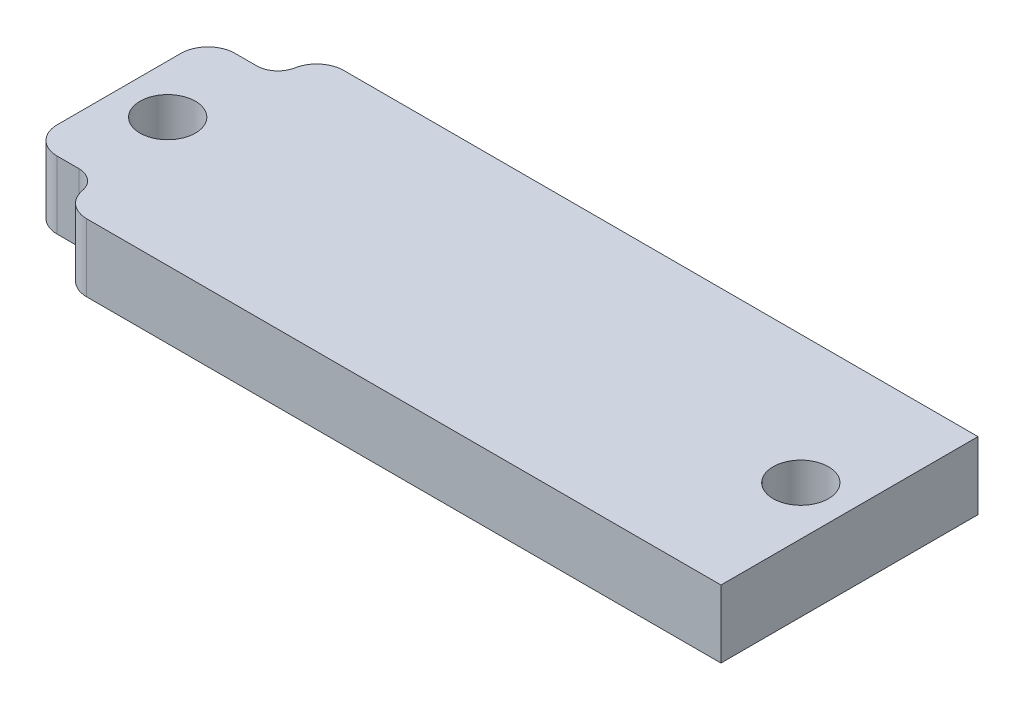
ISO-10303-21;
HEADER;
FILE_DESCRIPTION(('STEP AP214'),'2;1');
FILE_NAME('part.step','',(''),(''),'','','');
FILE_SCHEMA(('AUTOMOTIVE_DESIGN { 1 0 10303 214 1 1 1 1 }'));
ENDSEC;
DATA;
#1=APPLICATION_CONTEXT('core data for automotive mechanical design processes');
#2=APPLICATION_PROTOCOL_DEFINITION('international standard','automotive_design',2000,#1);
#3=PRODUCT_CONTEXT('',#1,'mechanical');
#4=PRODUCT('Part','Part','',(#3));
#5=PRODUCT_RELATED_PRODUCT_CATEGORY('part','',(#4));
#6=PRODUCT_DEFINITION_FORMATION('','',#4);
#7=PRODUCT_DEFINITION_CONTEXT('part definition',#1,'design');
#8=PRODUCT_DEFINITION('design','',#6,#7);
#9=PRODUCT_DEFINITION_SHAPE('','',#8);
#10=(LENGTH_UNIT() NAMED_UNIT(*) SI_UNIT(.MILLI.,.METRE.));
#11=(NAMED_UNIT(*) PLANE_ANGLE_UNIT() SI_UNIT($,.RADIAN.));
#12=(NAMED_UNIT(*) SI_UNIT($,.STERADIAN.) SOLID_ANGLE_UNIT());
#13=UNCERTAINTY_MEASURE_WITH_UNIT(LENGTH_MEASURE(1.E-05),#10,'distance_accuracy_value','');
#14=(GEOMETRIC_REPRESENTATION_CONTEXT(3) GLOBAL_UNCERTAINTY_ASSIGNED_CONTEXT((#13)) GLOBAL_UNIT_ASSIGNED_CONTEXT((#10,
#11,#12)) REPRESENTATION_CONTEXT('',''));
#15=CARTESIAN_POINT('',(0.,0.,0.));
#16=DIRECTION('',(0.,0.,1.));
#17=DIRECTION('',(1.,0.,0.));
#18=AXIS2_PLACEMENT_3D('',#15,#16,#17);
#19=CARTESIAN_POINT('',(0.,6.35,0.));
#20=DIRECTION('',(0.,-1.,0.));
#21=DIRECTION('',(0.,0.,-1.));
#22=AXIS2_PLACEMENT_3D('',#19,#20,#21);
#23=PLANE('',#22);
#24=CARTESIAN_POINT('',(4.57,6.35,-12.065));
#25=DIRECTION('',(0.,1.,0.));
#26=DIRECTION('',(0.,0.,1.));
#27=AXIS2_PLACEMENT_3D('',#24,#25,#26);
#28=CIRCLE('',#27,2.6);
#29=CARTESIAN_POINT('',(4.57,6.35,-9.465));
#30=VERTEX_POINT('',#29);
#31=EDGE_CURVE('E170',#30,#30,#28,.T.);
#32=ORIENTED_EDGE('',*,*,#31,.F.);
#33=EDGE_LOOP('',(#32));
#34=FACE_BOUND('',#33,.T.);
#35=CARTESIAN_POINT('',(64.01,6.35,-12.065));
#36=DIRECTION('',(0.,1.,0.));
#37=DIRECTION('',(0.,0.,1.));
#38=AXIS2_PLACEMENT_3D('',#35,#36,#37);
#39=CIRCLE('',#38,2.59999999999999);
#40=CARTESIAN_POINT('',(64.01,6.35,-9.46500000000001));
#41=VERTEX_POINT('',#40);
#42=EDGE_CURVE('E164',#41,#41,#39,.T.);
#43=ORIENTED_EDGE('',*,*,#42,.F.);
#44=EDGE_LOOP('',(#43));
#45=FACE_BOUND('',#44,.T.);
#46=CARTESIAN_POINT('',(4.57,6.35,-1.715));
#47=DIRECTION('',(0.,1.,0.));
#48=DIRECTION('',(0.,0.,1.));
#49=AXIS2_PLACEMENT_3D('',#46,#47,#48);
#50=CIRCLE('',#49,2.);
#51=CARTESIAN_POINT('',(4.57,6.35,-3.715));
#52=VERTEX_POINT('',#51);
#53=CARTESIAN_POINT('',(6.53670134597141,6.35,-2.07843612334802));
#54=VERTEX_POINT('',#53);
#55=EDGE_CURVE('E136',#52,#54,#50,.F.);
#56=ORIENTED_EDGE('',*,*,#55,.T.);
#57=CARTESIAN_POINT('',(9.03441205535511,6.35,-2.54));
#58=DIRECTION('',(0.,-1.,0.));
#59=DIRECTION('',(0.,0.,-1.));
#60=AXIS2_PLACEMENT_3D('',#57,#58,#59);
#61=CIRCLE('',#60,2.54);
#62=CARTESIAN_POINT('',(9.03441205535511,6.35,0.));
#63=VERTEX_POINT('',#62);
#64=EDGE_CURVE('E209',#54,#63,#61,.F.);
#65=ORIENTED_EDGE('',*,*,#64,.T.);
#66=DIRECTION('',(1.,0.,0.));
#67=VECTOR('',#66,1.);
#68=CARTESIAN_POINT('',(0.,6.35,0.));
#69=LINE('',#68,#67);
#70=CARTESIAN_POINT('',(68.58,6.35,0.));
#71=VERTEX_POINT('',#70);
#72=EDGE_CURVE('E179',#63,#71,#69,.T.);
#73=ORIENTED_EDGE('',*,*,#72,.T.);
#74=DIRECTION('',(0.,0.,-1.));
#75=VECTOR('',#74,1.);
#76=CARTESIAN_POINT('',(68.58,6.35,0.));
#77=LINE('',#76,#75);
#78=CARTESIAN_POINT('',(68.58,6.35,-24.13));
#79=VERTEX_POINT('',#78);
#80=EDGE_CURVE('E182',#71,#79,#77,.T.);
#81=ORIENTED_EDGE('',*,*,#80,.T.);
#82=DIRECTION('',(-1.,0.,0.));
#83=VECTOR('',#82,1.);
#84=CARTESIAN_POINT('',(0.,6.35,-24.13));
#85=LINE('',#84,#83);
#86=CARTESIAN_POINT('',(9.03441205535511,6.35,-24.13));
#87=VERTEX_POINT('',#86);
#88=EDGE_CURVE('E184',#79,#87,#85,.T.);
#89=ORIENTED_EDGE('',*,*,#88,.T.);
#90=CARTESIAN_POINT('',(9.03441205535511,6.35,-21.59));
#91=DIRECTION('',(0.,-1.,0.));
#92=DIRECTION('',(0.,0.,-1.));
#93=AXIS2_PLACEMENT_3D('',#90,#91,#92);
#94=CIRCLE('',#93,2.54);
#95=CARTESIAN_POINT('',(6.53670134597141,6.35,-22.051563876652));
#96=VERTEX_POINT('',#95);
#97=EDGE_CURVE('E203',#87,#96,#94,.F.);
#98=ORIENTED_EDGE('',*,*,#97,.T.);
#99=CARTESIAN_POINT('',(4.57,6.35,-22.415));
#100=DIRECTION('',(0.,1.,0.));
#101=DIRECTION('',(0.,0.,1.));
#102=AXIS2_PLACEMENT_3D('',#99,#100,#101);
#103=CIRCLE('',#102,2.);
#104=CARTESIAN_POINT('',(4.57,6.35,-20.415));
#105=VERTEX_POINT('',#104);
#106=EDGE_CURVE('E147',#105,#96,#103,.T.);
#107=ORIENTED_EDGE('',*,*,#106,.F.);
#108=DIRECTION('',(-1.,0.,0.));
#109=VECTOR('',#108,1.);
#110=CARTESIAN_POINT('',(0.,6.35,-20.415));
#111=LINE('',#110,#109);
#112=CARTESIAN_POINT('',(2.54,6.35,-20.415));
#113=VERTEX_POINT('',#112);
#114=EDGE_CURVE('E132',#105,#113,#111,.T.);
#115=ORIENTED_EDGE('',*,*,#114,.T.);
#116=CARTESIAN_POINT('',(2.54,6.35,-17.875));
#117=DIRECTION('',(0.,-1.,0.));
#118=DIRECTION('',(0.,0.,-1.));
#119=AXIS2_PLACEMENT_3D('',#116,#117,#118);
#120=CIRCLE('',#119,2.54);
#121=CARTESIAN_POINT('',(0.,6.35,-17.875));
#122=VERTEX_POINT('',#121);
#123=EDGE_CURVE('E205',#113,#122,#120,.F.);
#124=ORIENTED_EDGE('',*,*,#123,.T.);
#125=DIRECTION('',(0.,0.,1.));
#126=VECTOR('',#125,1.);
#127=CARTESIAN_POINT('',(0.,6.35,0.));
#128=LINE('',#127,#126);
#129=CARTESIAN_POINT('',(0.,6.35,-6.255));
#130=VERTEX_POINT('',#129);
#131=EDGE_CURVE('E176',#122,#130,#128,.T.);
#132=ORIENTED_EDGE('',*,*,#131,.T.);
#133=CARTESIAN_POINT('',(2.54,6.35,-6.255));
#134=DIRECTION('',(0.,-1.,0.));
#135=DIRECTION('',(0.,0.,-1.));
#136=AXIS2_PLACEMENT_3D('',#133,#134,#135);
#137=CIRCLE('',#136,2.54);
#138=CARTESIAN_POINT('',(2.54,6.35,-3.715));
#139=VERTEX_POINT('',#138);
#140=EDGE_CURVE('E207',#130,#139,#137,.F.);
#141=ORIENTED_EDGE('',*,*,#140,.T.);
#142=DIRECTION('',(-1.,0.,0.));
#143=VECTOR('',#142,1.);
#144=CARTESIAN_POINT('',(0.,6.35,-3.715));
#145=LINE('',#144,#143);
#146=EDGE_CURVE('E156',#52,#139,#145,.T.);
#147=ORIENTED_EDGE('',*,*,#146,.F.);
#148=EDGE_LOOP('',(#56,#65,#73,#81,#89,#98,#107,#115,#124,#132,#141,#147));
#149=FACE_BOUND('',#148,.T.);
#150=ADVANCED_FACE('F32',(#34,#45,#149),#23,.F.);
#151=CARTESIAN_POINT('',(0.,0.,0.));
#152=DIRECTION('',(0.,-1.,0.));
#153=DIRECTION('',(0.,0.,-1.));
#154=AXIS2_PLACEMENT_3D('',#151,#152,#153);
#155=PLANE('',#154);
#156=CARTESIAN_POINT('',(4.57,0.,-12.065));
#157=DIRECTION('',(0.,1.,0.));
#158=DIRECTION('',(0.,0.,1.));
#159=AXIS2_PLACEMENT_3D('',#156,#157,#158);
#160=CIRCLE('',#159,2.6);
#161=CARTESIAN_POINT('',(4.57,0.,-9.465));
#162=VERTEX_POINT('',#161);
#163=EDGE_CURVE('E167',#162,#162,#160,.T.);
#164=ORIENTED_EDGE('',*,*,#163,.T.);
#165=EDGE_LOOP('',(#164));
#166=FACE_BOUND('',#165,.T.);
#167=CARTESIAN_POINT('',(64.01,0.,-12.065));
#168=DIRECTION('',(0.,1.,0.));
#169=DIRECTION('',(0.,0.,1.));
#170=AXIS2_PLACEMENT_3D('',#167,#168,#169);
#171=CIRCLE('',#170,2.59999999999999);
#172=CARTESIAN_POINT('',(64.01,0.,-9.46500000000001));
#173=VERTEX_POINT('',#172);
#174=EDGE_CURVE('E163',#173,#173,#171,.T.);
#175=ORIENTED_EDGE('',*,*,#174,.T.);
#176=EDGE_LOOP('',(#175));
#177=FACE_BOUND('',#176,.T.);
#178=DIRECTION('',(1.,0.,0.));
#179=VECTOR('',#178,1.);
#180=CARTESIAN_POINT('',(0.,0.,0.));
#181=LINE('',#180,#179);
#182=CARTESIAN_POINT('',(9.03441205535511,0.,0.));
#183=VERTEX_POINT('',#182);
#184=CARTESIAN_POINT('',(68.58,0.,0.));
#185=VERTEX_POINT('',#184);
#186=EDGE_CURVE('E190',#183,#185,#181,.T.);
#187=ORIENTED_EDGE('',*,*,#186,.F.);
#188=CARTESIAN_POINT('',(9.03441205535511,0.,-2.54));
#189=DIRECTION('',(0.,-1.,0.));
#190=DIRECTION('',(0.,0.,-1.));
#191=AXIS2_PLACEMENT_3D('',#188,#189,#190);
#192=CIRCLE('',#191,2.54);
#193=CARTESIAN_POINT('',(6.53670134597141,0.,-2.07843612334802));
#194=VERTEX_POINT('',#193);
#195=EDGE_CURVE('E217',#183,#194,#192,.T.);
#196=ORIENTED_EDGE('',*,*,#195,.T.);
#197=CARTESIAN_POINT('',(4.57,0.,-1.715));
#198=DIRECTION('',(0.,1.,0.));
#199=DIRECTION('',(0.,0.,1.));
#200=AXIS2_PLACEMENT_3D('',#197,#198,#199);
#201=CIRCLE('',#200,2.);
#202=CARTESIAN_POINT('',(4.57,0.,-3.715));
#203=VERTEX_POINT('',#202);
#204=EDGE_CURVE('E152',#203,#194,#201,.F.);
#205=ORIENTED_EDGE('',*,*,#204,.F.);
#206=DIRECTION('',(-1.,0.,0.));
#207=VECTOR('',#206,1.);
#208=CARTESIAN_POINT('',(0.,0.,-3.715));
#209=LINE('',#208,#207);
#210=CARTESIAN_POINT('',(2.54,0.,-3.715));
#211=VERTEX_POINT('',#210);
#212=EDGE_CURVE('E155',#203,#211,#209,.T.);
#213=ORIENTED_EDGE('',*,*,#212,.T.);
#214=CARTESIAN_POINT('',(2.54,0.,-6.255));
#215=DIRECTION('',(0.,-1.,0.));
#216=DIRECTION('',(0.,0.,-1.));
#217=AXIS2_PLACEMENT_3D('',#214,#215,#216);
#218=CIRCLE('',#217,2.54);
#219=CARTESIAN_POINT('',(0.,0.,-6.255));
#220=VERTEX_POINT('',#219);
#221=EDGE_CURVE('E215',#211,#220,#218,.T.);
#222=ORIENTED_EDGE('',*,*,#221,.T.);
#223=DIRECTION('',(0.,0.,1.));
#224=VECTOR('',#223,1.);
#225=CARTESIAN_POINT('',(0.,0.,0.));
#226=LINE('',#225,#224);
#227=CARTESIAN_POINT('',(0.,0.,-17.875));
#228=VERTEX_POINT('',#227);
#229=EDGE_CURVE('E173',#228,#220,#226,.T.);
#230=ORIENTED_EDGE('',*,*,#229,.F.);
#231=CARTESIAN_POINT('',(2.54,0.,-17.875));
#232=DIRECTION('',(0.,-1.,0.));
#233=DIRECTION('',(0.,0.,-1.));
#234=AXIS2_PLACEMENT_3D('',#231,#232,#233);
#235=CIRCLE('',#234,2.54);
#236=CARTESIAN_POINT('',(2.54,0.,-20.415));
#237=VERTEX_POINT('',#236);
#238=EDGE_CURVE('E146',#228,#237,#235,.T.);
#239=ORIENTED_EDGE('',*,*,#238,.T.);
#240=DIRECTION('',(-1.,0.,0.));
#241=VECTOR('',#240,1.);
#242=CARTESIAN_POINT('',(0.,0.,-20.415));
#243=LINE('',#242,#241);
#244=CARTESIAN_POINT('',(4.57,0.,-20.415));
#245=VERTEX_POINT('',#244);
#246=EDGE_CURVE('E129',#245,#237,#243,.T.);
#247=ORIENTED_EDGE('',*,*,#246,.F.);
#248=CARTESIAN_POINT('',(4.57,0.,-22.415));
#249=DIRECTION('',(0.,1.,0.));
#250=DIRECTION('',(0.,0.,1.));
#251=AXIS2_PLACEMENT_3D('',#248,#249,#250);
#252=CIRCLE('',#251,2.);
#253=CARTESIAN_POINT('',(6.53670134597141,0.,-22.051563876652));
#254=VERTEX_POINT('',#253);
#255=EDGE_CURVE('E137',#245,#254,#252,.T.);
#256=ORIENTED_EDGE('',*,*,#255,.T.);
#257=CARTESIAN_POINT('',(9.03441205535511,0.,-21.59));
#258=DIRECTION('',(0.,-1.,0.));
#259=DIRECTION('',(0.,0.,-1.));
#260=AXIS2_PLACEMENT_3D('',#257,#258,#259);
#261=CIRCLE('',#260,2.54);
#262=CARTESIAN_POINT('',(9.03441205535511,0.,-24.13));
#263=VERTEX_POINT('',#262);
#264=EDGE_CURVE('E55',#254,#263,#261,.T.);
#265=ORIENTED_EDGE('',*,*,#264,.T.);
#266=DIRECTION('',(-1.,0.,0.));
#267=VECTOR('',#266,1.);
#268=CARTESIAN_POINT('',(0.,0.,-24.13));
#269=LINE('',#268,#267);
#270=CARTESIAN_POINT('',(68.58,0.,-24.13));
#271=VERTEX_POINT('',#270);
#272=EDGE_CURVE('E180',#271,#263,#269,.T.);
#273=ORIENTED_EDGE('',*,*,#272,.F.);
#274=DIRECTION('',(0.,0.,-1.));
#275=VECTOR('',#274,1.);
#276=CARTESIAN_POINT('',(68.58,0.,0.));
#277=LINE('',#276,#275);
#278=EDGE_CURVE('E192',#185,#271,#277,.T.);
#279=ORIENTED_EDGE('',*,*,#278,.F.);
#280=EDGE_LOOP('',(#187,#196,#205,#213,#222,#230,#239,#247,#256,#265,#273,#279));
#281=FACE_BOUND('',#280,.T.);
#282=ADVANCED_FACE('F143',(#166,#177,#281),#155,.T.);
#283=CARTESIAN_POINT('',(0.,6.35,0.));
#284=DIRECTION('',(1.,0.,0.));
#285=DIRECTION('',(0.,0.,-1.));
#286=AXIS2_PLACEMENT_3D('',#283,#284,#285);
#287=PLANE('',#286);
#288=ORIENTED_EDGE('',*,*,#229,.T.);
#289=DIRECTION('',(0.,1.,0.));
#290=VECTOR('',#289,1.);
#291=CARTESIAN_POINT('',(0.,6.35,-6.255));
#292=LINE('',#291,#290);
#293=EDGE_CURVE('E221',#220,#130,#292,.T.);
#294=ORIENTED_EDGE('',*,*,#293,.T.);
#295=ORIENTED_EDGE('',*,*,#131,.F.);
#296=DIRECTION('',(0.,1.,0.));
#297=VECTOR('',#296,1.);
#298=CARTESIAN_POINT('',(0.,0.,-17.875));
#299=LINE('',#298,#297);
#300=EDGE_CURVE('E219',#122,#228,#299,.F.);
#301=ORIENTED_EDGE('',*,*,#300,.T.);
#302=EDGE_LOOP('',(#288,#294,#295,#301));
#303=FACE_BOUND('',#302,.T.);
#304=ADVANCED_FACE('F257',(#303),#287,.F.);
#305=CARTESIAN_POINT('',(0.,6.35,0.));
#306=DIRECTION('',(0.,0.,-1.));
#307=DIRECTION('',(-1.,0.,0.));
#308=AXIS2_PLACEMENT_3D('',#305,#306,#307);
#309=PLANE('',#308);
#310=ORIENTED_EDGE('',*,*,#72,.F.);
#311=DIRECTION('',(0.,-1.,0.));
#312=VECTOR('',#311,1.);
#313=CARTESIAN_POINT('',(9.03441205535511,0.,0.));
#314=LINE('',#313,#312);
#315=EDGE_CURVE('E211',#63,#183,#314,.T.);
#316=ORIENTED_EDGE('',*,*,#315,.T.);
#317=ORIENTED_EDGE('',*,*,#186,.T.);
#318=DIRECTION('',(0.,-1.,0.));
#319=VECTOR('',#318,1.);
#320=CARTESIAN_POINT('',(68.58,6.35,0.));
#321=LINE('',#320,#319);
#322=EDGE_CURVE('E197',#71,#185,#321,.T.);
#323=ORIENTED_EDGE('',*,*,#322,.F.);
#324=EDGE_LOOP('',(#310,#316,#317,#323));
#325=FACE_BOUND('',#324,.T.);
#326=ADVANCED_FACE('F284',(#325),#309,.F.);
#327=CARTESIAN_POINT('',(68.58,6.35,0.));
#328=DIRECTION('',(-1.,0.,0.));
#329=DIRECTION('',(0.,0.,1.));
#330=AXIS2_PLACEMENT_3D('',#327,#328,#329);
#331=PLANE('',#330);
#332=ORIENTED_EDGE('',*,*,#278,.T.);
#333=DIRECTION('',(0.,-1.,0.));
#334=VECTOR('',#333,1.);
#335=CARTESIAN_POINT('',(68.58,6.35,-24.13));
#336=LINE('',#335,#334);
#337=EDGE_CURVE('E187',#79,#271,#336,.T.);
#338=ORIENTED_EDGE('',*,*,#337,.F.);
#339=ORIENTED_EDGE('',*,*,#80,.F.);
#340=ORIENTED_EDGE('',*,*,#322,.T.);
#341=EDGE_LOOP('',(#332,#338,#339,#340));
#342=FACE_BOUND('',#341,.T.);
#343=ADVANCED_FACE('F238',(#342),#331,.F.);
#344=CARTESIAN_POINT('',(0.,6.35,-24.13));
#345=DIRECTION('',(0.,0.,1.));
#346=DIRECTION('',(1.,0.,0.));
#347=AXIS2_PLACEMENT_3D('',#344,#345,#346);
#348=PLANE('',#347);
#349=ORIENTED_EDGE('',*,*,#272,.T.);
#350=DIRECTION('',(0.,1.,0.));
#351=VECTOR('',#350,1.);
#352=CARTESIAN_POINT('',(9.03441205535511,6.35,-24.13));
#353=LINE('',#352,#351);
#354=EDGE_CURVE('E40',#263,#87,#353,.T.);
#355=ORIENTED_EDGE('',*,*,#354,.T.);
#356=ORIENTED_EDGE('',*,*,#88,.F.);
#357=ORIENTED_EDGE('',*,*,#337,.T.);
#358=EDGE_LOOP('',(#349,#355,#356,#357));
#359=FACE_BOUND('',#358,.T.);
#360=ADVANCED_FACE('F230',(#359),#348,.F.);
#361=CARTESIAN_POINT('',(4.57,6.35,-12.065));
#362=DIRECTION('',(0.,-1.,0.));
#363=DIRECTION('',(0.,0.,-1.));
#364=AXIS2_PLACEMENT_3D('',#361,#362,#363);
#365=CYLINDRICAL_SURFACE('',#364,2.6);
#366=ORIENTED_EDGE('',*,*,#31,.T.);
#367=EDGE_LOOP('',(#366));
#368=FACE_BOUND('',#367,.T.);
#369=ORIENTED_EDGE('',*,*,#163,.F.);
#370=EDGE_LOOP('',(#369));
#371=FACE_BOUND('',#370,.T.);
#372=ADVANCED_FACE('F277',(#368,#371),#365,.F.);
#373=CARTESIAN_POINT('',(64.01,6.35,-12.065));
#374=DIRECTION('',(0.,-1.,0.));
#375=DIRECTION('',(0.,0.,-1.));
#376=AXIS2_PLACEMENT_3D('',#373,#374,#375);
#377=CYLINDRICAL_SURFACE('',#376,2.59999999999999);
#378=ORIENTED_EDGE('',*,*,#42,.T.);
#379=EDGE_LOOP('',(#378));
#380=FACE_BOUND('',#379,.T.);
#381=ORIENTED_EDGE('',*,*,#174,.F.);
#382=EDGE_LOOP('',(#381));
#383=FACE_BOUND('',#382,.T.);
#384=ADVANCED_FACE('F341',(#380,#383),#377,.F.);
#385=CARTESIAN_POINT('',(4.57,0.,-1.715));
#386=DIRECTION('',(0.,1.,0.));
#387=DIRECTION('',(0.,0.,1.));
#388=AXIS2_PLACEMENT_3D('',#385,#386,#387);
#389=CYLINDRICAL_SURFACE('',#388,2.);
#390=ORIENTED_EDGE('',*,*,#204,.T.);
#391=DIRECTION('',(0.,1.,0.));
#392=VECTOR('',#391,1.);
#393=CARTESIAN_POINT('',(6.53670134597141,0.,-2.07843612334802));
#394=LINE('',#393,#392);
#395=EDGE_CURVE('E200',#194,#54,#394,.T.);
#396=ORIENTED_EDGE('',*,*,#395,.T.);
#397=ORIENTED_EDGE('',*,*,#55,.F.);
#398=DIRECTION('',(0.,1.,0.));
#399=VECTOR('',#398,1.);
#400=CARTESIAN_POINT('',(4.57,0.,-3.715));
#401=LINE('',#400,#399);
#402=EDGE_CURVE('E158',#203,#52,#401,.T.);
#403=ORIENTED_EDGE('',*,*,#402,.F.);
#404=EDGE_LOOP('',(#390,#396,#397,#403));
#405=FACE_BOUND('',#404,.T.);
#406=ADVANCED_FACE('F249',(#405),#389,.F.);
#407=CARTESIAN_POINT('',(0.,0.,-3.715));
#408=DIRECTION('',(0.,0.,-1.));
#409=DIRECTION('',(-1.,0.,0.));
#410=AXIS2_PLACEMENT_3D('',#407,#408,#409);
#411=PLANE('',#410);
#412=ORIENTED_EDGE('',*,*,#146,.T.);
#413=DIRECTION('',(0.,1.,0.));
#414=VECTOR('',#413,1.);
#415=CARTESIAN_POINT('',(2.54,0.,-3.715));
#416=LINE('',#415,#414);
#417=EDGE_CURVE('E47',#139,#211,#416,.F.);
#418=ORIENTED_EDGE('',*,*,#417,.T.);
#419=ORIENTED_EDGE('',*,*,#212,.F.);
#420=ORIENTED_EDGE('',*,*,#402,.T.);
#421=EDGE_LOOP('',(#412,#418,#419,#420));
#422=FACE_BOUND('',#421,.T.);
#423=ADVANCED_FACE('F251',(#422),#411,.F.);
#424=CARTESIAN_POINT('',(0.,0.,-20.415));
#425=DIRECTION('',(0.,0.,-1.));
#426=DIRECTION('',(-1.,0.,0.));
#427=AXIS2_PLACEMENT_3D('',#424,#425,#426);
#428=PLANE('',#427);
#429=ORIENTED_EDGE('',*,*,#246,.T.);
#430=DIRECTION('',(0.,1.,0.));
#431=VECTOR('',#430,1.);
#432=CARTESIAN_POINT('',(2.54,6.35,-20.415));
#433=LINE('',#432,#431);
#434=EDGE_CURVE('E225',#237,#113,#433,.T.);
#435=ORIENTED_EDGE('',*,*,#434,.T.);
#436=ORIENTED_EDGE('',*,*,#114,.F.);
#437=DIRECTION('',(0.,1.,0.));
#438=VECTOR('',#437,1.);
#439=CARTESIAN_POINT('',(4.57,0.,-20.415));
#440=LINE('',#439,#438);
#441=EDGE_CURVE('E124',#245,#105,#440,.T.);
#442=ORIENTED_EDGE('',*,*,#441,.F.);
#443=EDGE_LOOP('',(#429,#435,#436,#442));
#444=FACE_BOUND('',#443,.T.);
#445=ADVANCED_FACE('F126',(#444),#428,.T.);
#446=CARTESIAN_POINT('',(4.57,0.,-22.415));
#447=DIRECTION('',(0.,1.,0.));
#448=DIRECTION('',(0.,0.,1.));
#449=AXIS2_PLACEMENT_3D('',#446,#447,#448);
#450=CYLINDRICAL_SURFACE('',#449,2.);
#451=ORIENTED_EDGE('',*,*,#106,.T.);
#452=DIRECTION('',(0.,1.,0.));
#453=VECTOR('',#452,1.);
#454=CARTESIAN_POINT('',(6.53670134597141,0.,-22.051563876652));
#455=LINE('',#454,#453);
#456=EDGE_CURVE('E11',#96,#254,#455,.F.);
#457=ORIENTED_EDGE('',*,*,#456,.T.);
#458=ORIENTED_EDGE('',*,*,#255,.F.);
#459=ORIENTED_EDGE('',*,*,#441,.T.);
#460=EDGE_LOOP('',(#451,#457,#458,#459));
#461=FACE_BOUND('',#460,.T.);
#462=ADVANCED_FACE('F139',(#461),#450,.F.);
#463=CARTESIAN_POINT('',(9.03441205535511,0.,-2.54));
#464=DIRECTION('',(0.,1.,0.));
#465=DIRECTION('',(0.,0.,1.));
#466=AXIS2_PLACEMENT_3D('',#463,#464,#465);
#467=CYLINDRICAL_SURFACE('',#466,2.54);
#468=ORIENTED_EDGE('',*,*,#195,.F.);
#469=ORIENTED_EDGE('',*,*,#315,.F.);
#470=ORIENTED_EDGE('',*,*,#64,.F.);
#471=ORIENTED_EDGE('',*,*,#395,.F.);
#472=EDGE_LOOP('',(#468,#469,#470,#471));
#473=FACE_BOUND('',#472,.T.);
#474=ADVANCED_FACE('F246',(#473),#467,.T.);
#475=CARTESIAN_POINT('',(2.54,6.35,-6.255));
#476=DIRECTION('',(0.,1.,0.));
#477=DIRECTION('',(0.,0.,1.));
#478=AXIS2_PLACEMENT_3D('',#475,#476,#477);
#479=CYLINDRICAL_SURFACE('',#478,2.54);
#480=ORIENTED_EDGE('',*,*,#221,.F.);
#481=ORIENTED_EDGE('',*,*,#417,.F.);
#482=ORIENTED_EDGE('',*,*,#140,.F.);
#483=ORIENTED_EDGE('',*,*,#293,.F.);
#484=EDGE_LOOP('',(#480,#481,#482,#483));
#485=FACE_BOUND('',#484,.T.);
#486=ADVANCED_FACE('F254',(#485),#479,.T.);
#487=CARTESIAN_POINT('',(2.54,0.,-17.875));
#488=DIRECTION('',(0.,-1.,0.));
#489=DIRECTION('',(0.,0.,-1.));
#490=AXIS2_PLACEMENT_3D('',#487,#488,#489);
#491=CYLINDRICAL_SURFACE('',#490,2.54);
#492=ORIENTED_EDGE('',*,*,#238,.F.);
#493=ORIENTED_EDGE('',*,*,#300,.F.);
#494=ORIENTED_EDGE('',*,*,#123,.F.);
#495=ORIENTED_EDGE('',*,*,#434,.F.);
#496=EDGE_LOOP('',(#492,#493,#494,#495));
#497=FACE_BOUND('',#496,.T.);
#498=ADVANCED_FACE('F261',(#497),#491,.T.);
#499=CARTESIAN_POINT('',(9.03441205535511,0.,-21.59));
#500=DIRECTION('',(0.,1.,0.));
#501=DIRECTION('',(0.,0.,1.));
#502=AXIS2_PLACEMENT_3D('',#499,#500,#501);
#503=CYLINDRICAL_SURFACE('',#502,2.54);
#504=ORIENTED_EDGE('',*,*,#264,.F.);
#505=ORIENTED_EDGE('',*,*,#456,.F.);
#506=ORIENTED_EDGE('',*,*,#97,.F.);
#507=ORIENTED_EDGE('',*,*,#354,.F.);
#508=EDGE_LOOP('',(#504,#505,#506,#507));
#509=FACE_BOUND('',#508,.T.);
#510=ADVANCED_FACE('F34',(#509),#503,.T.);
#511=CLOSED_SHELL('',(#150,#282,#304,#326,#343,#360,#372,#384,#406,#423,#445,#462,#474,#486,
#498,#510));
#512=MANIFOLD_SOLID_BREP('B2',#511);
#513=ADVANCED_BREP_SHAPE_REPRESENTATION('',(#18,#512),#14);
#514=SHAPE_DEFINITION_REPRESENTATION(#9,#513);
ENDSEC;
END-ISO-10303-21;
